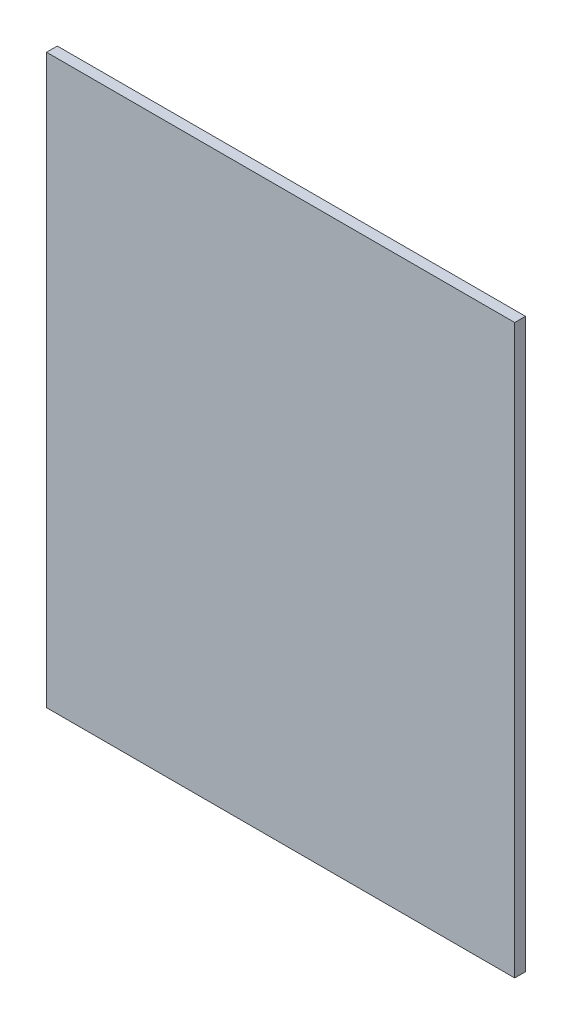
ISO-10303-21;
HEADER;
FILE_DESCRIPTION(('STEP AP214'),'2;1');
FILE_NAME('part.step','',(''),(''),'','','');
FILE_SCHEMA(('AUTOMOTIVE_DESIGN { 1 0 10303 214 1 1 1 1 }'));
ENDSEC;
DATA;
#1=APPLICATION_CONTEXT('core data for automotive mechanical design processes');
#2=APPLICATION_PROTOCOL_DEFINITION('international standard','automotive_design',2000,#1);
#3=PRODUCT_CONTEXT('',#1,'mechanical');
#4=PRODUCT('Part','Part','',(#3));
#5=PRODUCT_RELATED_PRODUCT_CATEGORY('part','',(#4));
#6=PRODUCT_DEFINITION_FORMATION('','',#4);
#7=PRODUCT_DEFINITION_CONTEXT('part definition',#1,'design');
#8=PRODUCT_DEFINITION('design','',#6,#7);
#9=PRODUCT_DEFINITION_SHAPE('','',#8);
#10=(LENGTH_UNIT() NAMED_UNIT(*) SI_UNIT(.MILLI.,.METRE.));
#11=(NAMED_UNIT(*) PLANE_ANGLE_UNIT() SI_UNIT($,.RADIAN.));
#12=(NAMED_UNIT(*) SI_UNIT($,.STERADIAN.) SOLID_ANGLE_UNIT());
#13=UNCERTAINTY_MEASURE_WITH_UNIT(LENGTH_MEASURE(1.E-05),#10,'distance_accuracy_value','');
#14=(GEOMETRIC_REPRESENTATION_CONTEXT(3) GLOBAL_UNCERTAINTY_ASSIGNED_CONTEXT((#13)) GLOBAL_UNIT_ASSIGNED_CONTEXT((#10,
#11,#12)) REPRESENTATION_CONTEXT('',''));
#15=CARTESIAN_POINT('',(0.,0.,0.));
#16=DIRECTION('',(0.,0.,1.));
#17=DIRECTION('',(1.,0.,0.));
#18=AXIS2_PLACEMENT_3D('',#15,#16,#17);
#19=CARTESIAN_POINT('',(44.7971998147837,-426.085183533713,4.));
#20=DIRECTION('',(-1.,0.,0.));
#21=DIRECTION('',(0.,-1.,0.));
#22=AXIS2_PLACEMENT_3D('',#19,#20,#21);
#23=PLANE('',#22);
#24=DIRECTION('',(0.,1.,0.));
#25=VECTOR('',#24,1.);
#26=CARTESIAN_POINT('',(44.7971998147837,-426.085183533713,0.));
#27=LINE('',#26,#25);
#28=CARTESIAN_POINT('',(44.7971998147837,-426.085183533713,0.));
#29=VERTEX_POINT('',#28);
#30=CARTESIAN_POINT('',(44.7971998147837,-215.037785913899,0.));
#31=VERTEX_POINT('',#30);
#32=EDGE_CURVE('E95',#29,#31,#27,.T.);
#33=ORIENTED_EDGE('',*,*,#32,.T.);
#34=DIRECTION('',(0.,0.,-1.));
#35=VECTOR('',#34,1.);
#36=CARTESIAN_POINT('',(44.7971998147837,-215.037785913899,4.));
#37=LINE('',#36,#35);
#38=CARTESIAN_POINT('',(44.7971998147837,-215.037785913899,4.));
#39=VERTEX_POINT('',#38);
#40=EDGE_CURVE('E11',#39,#31,#37,.T.);
#41=ORIENTED_EDGE('',*,*,#40,.F.);
#42=DIRECTION('',(0.,1.,0.));
#43=VECTOR('',#42,1.);
#44=CARTESIAN_POINT('',(44.7971998147837,-426.085183533713,4.));
#45=LINE('',#44,#43);
#46=CARTESIAN_POINT('',(44.7971998147837,-426.085183533713,4.));
#47=VERTEX_POINT('',#46);
#48=EDGE_CURVE('E83',#47,#39,#45,.T.);
#49=ORIENTED_EDGE('',*,*,#48,.F.);
#50=DIRECTION('',(0.,0.,-1.));
#51=VECTOR('',#50,1.);
#52=CARTESIAN_POINT('',(44.7971998147837,-426.085183533713,4.));
#53=LINE('',#52,#51);
#54=EDGE_CURVE('E91',#47,#29,#53,.T.);
#55=ORIENTED_EDGE('',*,*,#54,.T.);
#56=EDGE_LOOP('',(#33,#41,#49,#55));
#57=FACE_BOUND('',#56,.T.);
#58=ADVANCED_FACE('F32',(#57),#23,.F.);
#59=CARTESIAN_POINT('',(-129.266961018417,-215.037785913899,4.));
#60=DIRECTION('',(0.,-1.,0.));
#61=DIRECTION('',(0.,0.,-1.));
#62=AXIS2_PLACEMENT_3D('',#59,#60,#61);
#63=PLANE('',#62);
#64=DIRECTION('',(-1.,0.,0.));
#65=VECTOR('',#64,1.);
#66=CARTESIAN_POINT('',(-129.266961018417,-215.037785913899,0.));
#67=LINE('',#66,#65);
#68=CARTESIAN_POINT('',(-129.266961018417,-215.037785913899,0.));
#69=VERTEX_POINT('',#68);
#70=EDGE_CURVE('E87',#31,#69,#67,.T.);
#71=ORIENTED_EDGE('',*,*,#70,.T.);
#72=DIRECTION('',(0.,0.,-1.));
#73=VECTOR('',#72,1.);
#74=CARTESIAN_POINT('',(-129.266961018417,-215.037785913899,4.));
#75=LINE('',#74,#73);
#76=CARTESIAN_POINT('',(-129.266961018417,-215.037785913899,4.));
#77=VERTEX_POINT('',#76);
#78=EDGE_CURVE('E40',#77,#69,#75,.T.);
#79=ORIENTED_EDGE('',*,*,#78,.F.);
#80=DIRECTION('',(-1.,0.,0.));
#81=VECTOR('',#80,1.);
#82=CARTESIAN_POINT('',(-129.266961018417,-215.037785913899,4.));
#83=LINE('',#82,#81);
#84=EDGE_CURVE('E78',#39,#77,#83,.T.);
#85=ORIENTED_EDGE('',*,*,#84,.F.);
#86=ORIENTED_EDGE('',*,*,#40,.T.);
#87=EDGE_LOOP('',(#71,#79,#85,#86));
#88=FACE_BOUND('',#87,.T.);
#89=ADVANCED_FACE('F86',(#88),#63,.F.);
#90=CARTESIAN_POINT('',(-129.266961018417,-426.085183533713,4.));
#91=DIRECTION('',(1.,0.,0.));
#92=DIRECTION('',(0.,0.,-1.));
#93=AXIS2_PLACEMENT_3D('',#90,#91,#92);
#94=PLANE('',#93);
#95=DIRECTION('',(0.,-1.,0.));
#96=VECTOR('',#95,1.);
#97=CARTESIAN_POINT('',(-129.266961018417,-426.085183533713,0.));
#98=LINE('',#97,#96);
#99=CARTESIAN_POINT('',(-129.266961018417,-426.085183533713,0.));
#100=VERTEX_POINT('',#99);
#101=EDGE_CURVE('E65',#69,#100,#98,.T.);
#102=ORIENTED_EDGE('',*,*,#101,.T.);
#103=DIRECTION('',(0.,0.,-1.));
#104=VECTOR('',#103,1.);
#105=CARTESIAN_POINT('',(-129.266961018417,-426.085183533713,4.));
#106=LINE('',#105,#104);
#107=CARTESIAN_POINT('',(-129.266961018417,-426.085183533713,4.));
#108=VERTEX_POINT('',#107);
#109=EDGE_CURVE('E88',#108,#100,#106,.T.);
#110=ORIENTED_EDGE('',*,*,#109,.F.);
#111=DIRECTION('',(0.,-1.,0.));
#112=VECTOR('',#111,1.);
#113=CARTESIAN_POINT('',(-129.266961018417,-426.085183533713,4.));
#114=LINE('',#113,#112);
#115=EDGE_CURVE('E81',#77,#108,#114,.T.);
#116=ORIENTED_EDGE('',*,*,#115,.F.);
#117=ORIENTED_EDGE('',*,*,#78,.T.);
#118=EDGE_LOOP('',(#102,#110,#116,#117));
#119=FACE_BOUND('',#118,.T.);
#120=ADVANCED_FACE('F89',(#119),#94,.F.);
#121=CARTESIAN_POINT('',(-129.266961018417,-426.085183533713,4.));
#122=DIRECTION('',(0.,1.,0.));
#123=DIRECTION('',(0.,0.,1.));
#124=AXIS2_PLACEMENT_3D('',#121,#122,#123);
#125=PLANE('',#124);
#126=DIRECTION('',(1.,0.,0.));
#127=VECTOR('',#126,1.);
#128=CARTESIAN_POINT('',(-129.266961018417,-426.085183533713,0.));
#129=LINE('',#128,#127);
#130=EDGE_CURVE('E71',#100,#29,#129,.T.);
#131=ORIENTED_EDGE('',*,*,#130,.T.);
#132=ORIENTED_EDGE('',*,*,#54,.F.);
#133=DIRECTION('',(1.,0.,0.));
#134=VECTOR('',#133,1.);
#135=CARTESIAN_POINT('',(-129.266961018417,-426.085183533713,4.));
#136=LINE('',#135,#134);
#137=EDGE_CURVE('E48',#108,#47,#136,.T.);
#138=ORIENTED_EDGE('',*,*,#137,.F.);
#139=ORIENTED_EDGE('',*,*,#109,.T.);
#140=EDGE_LOOP('',(#131,#132,#138,#139));
#141=FACE_BOUND('',#140,.T.);
#142=ADVANCED_FACE('F102',(#141),#125,.F.);
#143=CARTESIAN_POINT('',(0.,0.,4.));
#144=DIRECTION('',(0.,0.,-1.));
#145=DIRECTION('',(-1.,0.,0.));
#146=AXIS2_PLACEMENT_3D('',#143,#144,#145);
#147=PLANE('',#146);
#148=ORIENTED_EDGE('',*,*,#48,.T.);
#149=ORIENTED_EDGE('',*,*,#84,.T.);
#150=ORIENTED_EDGE('',*,*,#115,.T.);
#151=ORIENTED_EDGE('',*,*,#137,.T.);
#152=EDGE_LOOP('',(#148,#149,#150,#151));
#153=FACE_BOUND('',#152,.T.);
#154=ADVANCED_FACE('F79',(#153),#147,.F.);
#155=CARTESIAN_POINT('',(0.,0.,0.));
#156=DIRECTION('',(0.,0.,-1.));
#157=DIRECTION('',(-1.,0.,0.));
#158=AXIS2_PLACEMENT_3D('',#155,#156,#157);
#159=PLANE('',#158);
#160=ORIENTED_EDGE('',*,*,#32,.F.);
#161=ORIENTED_EDGE('',*,*,#130,.F.);
#162=ORIENTED_EDGE('',*,*,#101,.F.);
#163=ORIENTED_EDGE('',*,*,#70,.F.);
#164=EDGE_LOOP('',(#160,#161,#162,#163));
#165=FACE_BOUND('',#164,.T.);
#166=ADVANCED_FACE('F105',(#165),#159,.T.);
#167=CLOSED_SHELL('',(#58,#89,#120,#142,#154,#166));
#168=MANIFOLD_SOLID_BREP('B2',#167);
#169=ADVANCED_BREP_SHAPE_REPRESENTATION('',(#18,#168),#14);
#170=SHAPE_DEFINITION_REPRESENTATION(#9,#169);
ENDSEC;
END-ISO-10303-21;
